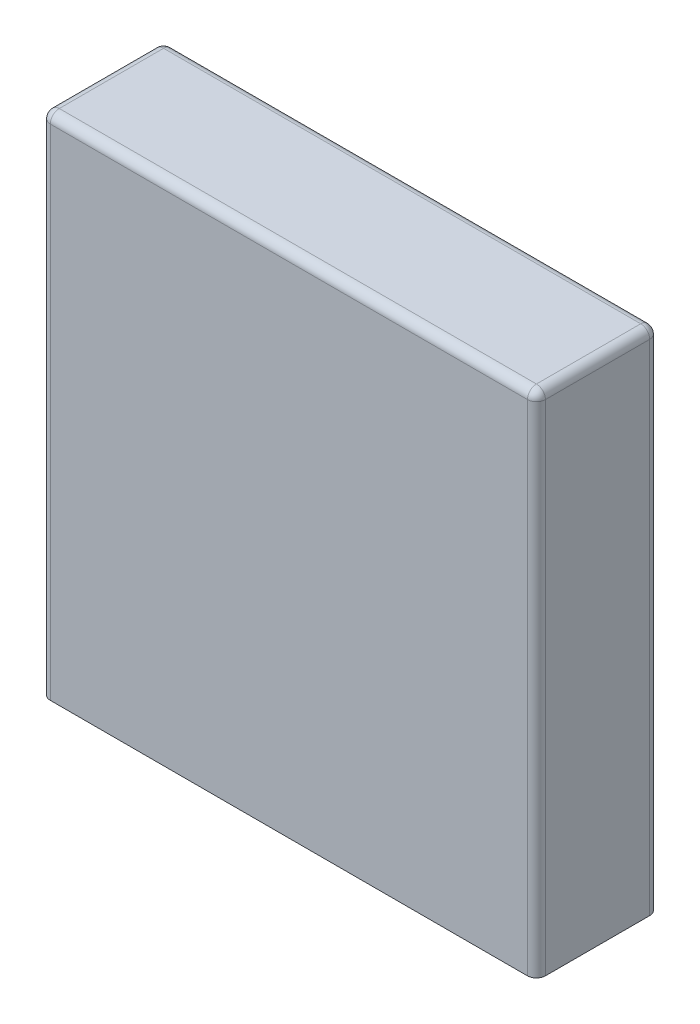
ISO-10303-21;
HEADER;
FILE_DESCRIPTION(('STEP AP214'),'2;1');
FILE_NAME('part.step','',(''),(''),'','','');
FILE_SCHEMA(('AUTOMOTIVE_DESIGN { 1 0 10303 214 1 1 1 1 }'));
ENDSEC;
DATA;
#1=APPLICATION_CONTEXT('core data for automotive mechanical design processes');
#2=APPLICATION_PROTOCOL_DEFINITION('international standard','automotive_design',2000,#1);
#3=PRODUCT_CONTEXT('',#1,'mechanical');
#4=PRODUCT('Part','Part','',(#3));
#5=PRODUCT_RELATED_PRODUCT_CATEGORY('part','',(#4));
#6=PRODUCT_DEFINITION_FORMATION('','',#4);
#7=PRODUCT_DEFINITION_CONTEXT('part definition',#1,'design');
#8=PRODUCT_DEFINITION('design','',#6,#7);
#9=PRODUCT_DEFINITION_SHAPE('','',#8);
#10=(LENGTH_UNIT() NAMED_UNIT(*) SI_UNIT(.MILLI.,.METRE.));
#11=(NAMED_UNIT(*) PLANE_ANGLE_UNIT() SI_UNIT($,.RADIAN.));
#12=(NAMED_UNIT(*) SI_UNIT($,.STERADIAN.) SOLID_ANGLE_UNIT());
#13=UNCERTAINTY_MEASURE_WITH_UNIT(LENGTH_MEASURE(1.E-05),#10,'distance_accuracy_value','');
#14=(GEOMETRIC_REPRESENTATION_CONTEXT(3) GLOBAL_UNCERTAINTY_ASSIGNED_CONTEXT((#13)) GLOBAL_UNIT_ASSIGNED_CONTEXT((#10,
#11,#12)) REPRESENTATION_CONTEXT('',''));
#15=CARTESIAN_POINT('',(0.,0.,0.));
#16=DIRECTION('',(0.,0.,1.));
#17=DIRECTION('',(1.,0.,0.));
#18=AXIS2_PLACEMENT_3D('',#15,#16,#17);
#19=CARTESIAN_POINT('',(-35.45,-84.45,17.));
#20=DIRECTION('',(0.,-1.,0.));
#21=DIRECTION('',(1.,0.,0.));
#22=AXIS2_PLACEMENT_3D('',#19,#20,#21);
#23=PLANE('',#22);
#24=CARTESIAN_POINT('',(35.45,-84.45,17.));
#25=DIRECTION('',(0.,1.,0.));
#26=DIRECTION('',(1.,0.,0.));
#27=AXIS2_PLACEMENT_3D('',#24,#25,#26);
#28=CIRCLE('',#27,2.5);
#29=CARTESIAN_POINT('',(37.95,-84.45,17.));
#30=VERTEX_POINT('',#29);
#31=CARTESIAN_POINT('',(32.95,-84.45,17.));
#32=VERTEX_POINT('',#31);
#33=EDGE_CURVE('E242',#30,#32,#28,.T.);
#34=ORIENTED_EDGE('',*,*,#33,.F.);
#35=CARTESIAN_POINT('',(35.45,-84.45,17.));
#36=DIRECTION('',(0.,1.,0.));
#37=DIRECTION('',(1.,0.,0.));
#38=AXIS2_PLACEMENT_3D('',#35,#36,#37);
#39=CIRCLE('',#38,2.5);
#40=EDGE_CURVE('E11',#32,#30,#39,.T.);
#41=ORIENTED_EDGE('',*,*,#40,.F.);
#42=EDGE_LOOP('',(#34,#41));
#43=FACE_BOUND('',#42,.T.);
#44=ADVANCED_FACE('F17',(#43),#23,.T.);
#45=CARTESIAN_POINT('',(35.45,-77.55,17.));
#46=DIRECTION('',(0.,-1.,0.));
#47=DIRECTION('',(1.,0.,0.));
#48=AXIS2_PLACEMENT_3D('',#45,#46,#47);
#49=CYLINDRICAL_SURFACE('',#48,2.5);
#50=DIRECTION('',(0.,1.,0.));
#51=VECTOR('',#50,1.);
#52=CARTESIAN_POINT('',(32.95,-77.55,17.));
#53=LINE('',#52,#51);
#54=CARTESIAN_POINT('',(32.95,-73.15,17.));
#55=VERTEX_POINT('',#54);
#56=EDGE_CURVE('E28',#32,#55,#53,.T.);
#57=ORIENTED_EDGE('',*,*,#56,.F.);
#58=ORIENTED_EDGE('',*,*,#40,.T.);
#59=DIRECTION('',(0.,1.,0.));
#60=VECTOR('',#59,1.);
#61=CARTESIAN_POINT('',(37.95,-77.55,17.));
#62=LINE('',#61,#60);
#63=CARTESIAN_POINT('',(37.95,-73.15,17.));
#64=VERTEX_POINT('',#63);
#65=EDGE_CURVE('E235',#30,#64,#62,.T.);
#66=ORIENTED_EDGE('',*,*,#65,.T.);
#67=CARTESIAN_POINT('',(35.45,-73.15,17.));
#68=DIRECTION('',(0.,1.,0.));
#69=DIRECTION('',(0.,0.,1.));
#70=AXIS2_PLACEMENT_3D('',#67,#68,#69);
#71=CIRCLE('',#70,2.5);
#72=EDGE_CURVE('E309',#55,#64,#71,.T.);
#73=ORIENTED_EDGE('',*,*,#72,.F.);
#74=EDGE_LOOP('',(#57,#58,#66,#73));
#75=FACE_BOUND('',#74,.T.);
#76=ADVANCED_FACE('F796',(#75),#49,.T.);
#77=CARTESIAN_POINT('',(35.45,-77.55,17.));
#78=DIRECTION('',(0.,-1.,0.));
#79=DIRECTION('',(1.,0.,0.));
#80=AXIS2_PLACEMENT_3D('',#77,#78,#79);
#81=CYLINDRICAL_SURFACE('',#80,2.5);
#82=ORIENTED_EDGE('',*,*,#65,.F.);
#83=ORIENTED_EDGE('',*,*,#33,.T.);
#84=ORIENTED_EDGE('',*,*,#56,.T.);
#85=CARTESIAN_POINT('',(35.45,-73.15,17.));
#86=DIRECTION('',(0.,1.,0.));
#87=DIRECTION('',(0.,0.,1.));
#88=AXIS2_PLACEMENT_3D('',#85,#86,#87);
#89=CIRCLE('',#88,2.5);
#90=EDGE_CURVE('E351',#64,#55,#89,.T.);
#91=ORIENTED_EDGE('',*,*,#90,.F.);
#92=EDGE_LOOP('',(#82,#83,#84,#91));
#93=FACE_BOUND('',#92,.T.);
#94=ADVANCED_FACE('F833',(#93),#81,.T.);
#95=CARTESIAN_POINT('',(35.45,-71.9,17.));
#96=DIRECTION('',(0.,-1.,0.));
#97=DIRECTION('',(1.,0.,0.));
#98=AXIS2_PLACEMENT_3D('',#95,#96,#97);
#99=CYLINDRICAL_SURFACE('',#98,5.);
#100=DIRECTION('',(0.,1.,0.));
#101=VECTOR('',#100,1.);
#102=CARTESIAN_POINT('',(40.45,-71.9,17.));
#103=LINE('',#102,#101);
#104=CARTESIAN_POINT('',(40.45,-73.15,17.));
#105=VERTEX_POINT('',#104);
#106=CARTESIAN_POINT('',(40.45,-70.65,17.));
#107=VERTEX_POINT('',#106);
#108=EDGE_CURVE('E263',#105,#107,#103,.T.);
#109=ORIENTED_EDGE('',*,*,#108,.F.);
#110=CARTESIAN_POINT('',(35.45,-73.15,17.));
#111=DIRECTION('',(0.,1.,0.));
#112=DIRECTION('',(0.,0.,1.));
#113=AXIS2_PLACEMENT_3D('',#110,#111,#112);
#114=CIRCLE('',#113,5.);
#115=CARTESIAN_POINT('',(30.45,-73.15,17.));
#116=VERTEX_POINT('',#115);
#117=EDGE_CURVE('E258',#105,#116,#114,.T.);
#118=ORIENTED_EDGE('',*,*,#117,.T.);
#119=DIRECTION('',(0.,1.,0.));
#120=VECTOR('',#119,1.);
#121=CARTESIAN_POINT('',(30.45,-71.9,17.));
#122=LINE('',#121,#120);
#123=CARTESIAN_POINT('',(30.45,-70.65,17.));
#124=VERTEX_POINT('',#123);
#125=EDGE_CURVE('E266',#116,#124,#122,.T.);
#126=ORIENTED_EDGE('',*,*,#125,.T.);
#127=CARTESIAN_POINT('',(35.45,-70.65,17.));
#128=DIRECTION('',(0.,1.,0.));
#129=DIRECTION('',(-1.,0.,0.));
#130=AXIS2_PLACEMENT_3D('',#127,#128,#129);
#131=CIRCLE('',#130,5.);
#132=EDGE_CURVE('E231',#107,#124,#131,.T.);
#133=ORIENTED_EDGE('',*,*,#132,.F.);
#134=EDGE_LOOP('',(#109,#118,#126,#133));
#135=FACE_BOUND('',#134,.T.);
#136=ADVANCED_FACE('F776',(#135),#99,.T.);
#137=CARTESIAN_POINT('',(35.45,-71.9,17.));
#138=DIRECTION('',(0.,-1.,0.));
#139=DIRECTION('',(1.,0.,0.));
#140=AXIS2_PLACEMENT_3D('',#137,#138,#139);
#141=CYLINDRICAL_SURFACE('',#140,5.);
#142=ORIENTED_EDGE('',*,*,#125,.F.);
#143=CARTESIAN_POINT('',(35.45,-73.15,17.));
#144=DIRECTION('',(0.,1.,0.));
#145=DIRECTION('',(0.,0.,1.));
#146=AXIS2_PLACEMENT_3D('',#143,#144,#145);
#147=CIRCLE('',#146,5.);
#148=EDGE_CURVE('E262',#116,#105,#147,.T.);
#149=ORIENTED_EDGE('',*,*,#148,.T.);
#150=ORIENTED_EDGE('',*,*,#108,.T.);
#151=CARTESIAN_POINT('',(35.45,-70.65,17.));
#152=DIRECTION('',(0.,1.,0.));
#153=DIRECTION('',(-1.,0.,0.));
#154=AXIS2_PLACEMENT_3D('',#151,#152,#153);
#155=CIRCLE('',#154,5.);
#156=EDGE_CURVE('E220',#124,#107,#155,.T.);
#157=ORIENTED_EDGE('',*,*,#156,.F.);
#158=EDGE_LOOP('',(#142,#149,#150,#157));
#159=FACE_BOUND('',#158,.T.);
#160=ADVANCED_FACE('F855',(#159),#141,.T.);
#161=CARTESIAN_POINT('',(-35.45,-73.15,17.));
#162=DIRECTION('',(0.,1.,0.));
#163=DIRECTION('',(0.,0.,1.));
#164=AXIS2_PLACEMENT_3D('',#161,#162,#163);
#165=PLANE('',#164);
#166=ORIENTED_EDGE('',*,*,#72,.T.);
#167=ORIENTED_EDGE('',*,*,#90,.T.);
#168=EDGE_LOOP('',(#166,#167));
#169=FACE_BOUND('',#168,.T.);
#170=ORIENTED_EDGE('',*,*,#117,.F.);
#171=ORIENTED_EDGE('',*,*,#148,.F.);
#172=EDGE_LOOP('',(#170,#171));
#173=FACE_BOUND('',#172,.T.);
#174=ADVANCED_FACE('F817',(#169,#173),#165,.F.);
#175=CARTESIAN_POINT('',(-35.45,-84.45,17.));
#176=DIRECTION('',(0.,-1.,0.));
#177=DIRECTION('',(1.,0.,0.));
#178=AXIS2_PLACEMENT_3D('',#175,#176,#177);
#179=PLANE('',#178);
#180=CARTESIAN_POINT('',(-35.45,-84.45,17.));
#181=DIRECTION('',(0.,1.,0.));
#182=DIRECTION('',(1.,0.,0.));
#183=AXIS2_PLACEMENT_3D('',#180,#181,#182);
#184=CIRCLE('',#183,2.5);
#185=CARTESIAN_POINT('',(-32.95,-84.45,17.));
#186=VERTEX_POINT('',#185);
#187=CARTESIAN_POINT('',(-37.95,-84.45,17.));
#188=VERTEX_POINT('',#187);
#189=EDGE_CURVE('E257',#186,#188,#184,.T.);
#190=ORIENTED_EDGE('',*,*,#189,.F.);
#191=CARTESIAN_POINT('',(-35.45,-84.45,17.));
#192=DIRECTION('',(0.,1.,0.));
#193=DIRECTION('',(1.,0.,0.));
#194=AXIS2_PLACEMENT_3D('',#191,#192,#193);
#195=CIRCLE('',#194,2.5);
#196=EDGE_CURVE('E256',#188,#186,#195,.T.);
#197=ORIENTED_EDGE('',*,*,#196,.F.);
#198=EDGE_LOOP('',(#190,#197));
#199=FACE_BOUND('',#198,.T.);
#200=ADVANCED_FACE('F920',(#199),#179,.T.);
#201=CARTESIAN_POINT('',(-35.45,-77.55,17.));
#202=DIRECTION('',(0.,-1.,0.));
#203=DIRECTION('',(1.,0.,0.));
#204=AXIS2_PLACEMENT_3D('',#201,#202,#203);
#205=CYLINDRICAL_SURFACE('',#204,2.5);
#206=DIRECTION('',(0.,1.,0.));
#207=VECTOR('',#206,1.);
#208=CARTESIAN_POINT('',(-37.95,-77.55,17.));
#209=LINE('',#208,#207);
#210=CARTESIAN_POINT('',(-37.95,-73.15,17.));
#211=VERTEX_POINT('',#210);
#212=EDGE_CURVE('E253',#188,#211,#209,.T.);
#213=ORIENTED_EDGE('',*,*,#212,.F.);
#214=ORIENTED_EDGE('',*,*,#196,.T.);
#215=DIRECTION('',(0.,1.,0.));
#216=VECTOR('',#215,1.);
#217=CARTESIAN_POINT('',(-32.95,-77.55,17.));
#218=LINE('',#217,#216);
#219=CARTESIAN_POINT('',(-32.95,-73.15,17.));
#220=VERTEX_POINT('',#219);
#221=EDGE_CURVE('E288',#186,#220,#218,.T.);
#222=ORIENTED_EDGE('',*,*,#221,.T.);
#223=CARTESIAN_POINT('',(-35.45,-73.15,17.));
#224=DIRECTION('',(0.,1.,0.));
#225=DIRECTION('',(0.,0.,1.));
#226=AXIS2_PLACEMENT_3D('',#223,#224,#225);
#227=CIRCLE('',#226,2.5);
#228=EDGE_CURVE('E344',#211,#220,#227,.T.);
#229=ORIENTED_EDGE('',*,*,#228,.F.);
#230=EDGE_LOOP('',(#213,#214,#222,#229));
#231=FACE_BOUND('',#230,.T.);
#232=ADVANCED_FACE('F770',(#231),#205,.T.);
#233=CARTESIAN_POINT('',(-35.45,-77.55,17.));
#234=DIRECTION('',(0.,-1.,0.));
#235=DIRECTION('',(1.,0.,0.));
#236=AXIS2_PLACEMENT_3D('',#233,#234,#235);
#237=CYLINDRICAL_SURFACE('',#236,2.5);
#238=ORIENTED_EDGE('',*,*,#221,.F.);
#239=ORIENTED_EDGE('',*,*,#189,.T.);
#240=ORIENTED_EDGE('',*,*,#212,.T.);
#241=CARTESIAN_POINT('',(-35.45,-73.15,17.));
#242=DIRECTION('',(0.,1.,0.));
#243=DIRECTION('',(0.,0.,1.));
#244=AXIS2_PLACEMENT_3D('',#241,#242,#243);
#245=CIRCLE('',#244,2.5);
#246=EDGE_CURVE('E284',#220,#211,#245,.T.);
#247=ORIENTED_EDGE('',*,*,#246,.F.);
#248=EDGE_LOOP('',(#238,#239,#240,#247));
#249=FACE_BOUND('',#248,.T.);
#250=ADVANCED_FACE('F890',(#249),#237,.T.);
#251=CARTESIAN_POINT('',(-35.45,-71.9,17.));
#252=DIRECTION('',(0.,-1.,0.));
#253=DIRECTION('',(1.,0.,0.));
#254=AXIS2_PLACEMENT_3D('',#251,#252,#253);
#255=CYLINDRICAL_SURFACE('',#254,5.);
#256=DIRECTION('',(0.,1.,0.));
#257=VECTOR('',#256,1.);
#258=CARTESIAN_POINT('',(-30.45,-71.9,17.));
#259=LINE('',#258,#257);
#260=CARTESIAN_POINT('',(-30.45,-73.15,17.));
#261=VERTEX_POINT('',#260);
#262=CARTESIAN_POINT('',(-30.45,-70.65,17.));
#263=VERTEX_POINT('',#262);
#264=EDGE_CURVE('E283',#261,#263,#259,.T.);
#265=ORIENTED_EDGE('',*,*,#264,.F.);
#266=CARTESIAN_POINT('',(-35.45,-73.15,17.));
#267=DIRECTION('',(0.,1.,0.));
#268=DIRECTION('',(0.,0.,1.));
#269=AXIS2_PLACEMENT_3D('',#266,#267,#268);
#270=CIRCLE('',#269,5.);
#271=CARTESIAN_POINT('',(-40.45,-73.15,17.));
#272=VERTEX_POINT('',#271);
#273=EDGE_CURVE('E279',#261,#272,#270,.T.);
#274=ORIENTED_EDGE('',*,*,#273,.T.);
#275=DIRECTION('',(0.,1.,0.));
#276=VECTOR('',#275,1.);
#277=CARTESIAN_POINT('',(-40.45,-71.9,17.));
#278=LINE('',#277,#276);
#279=CARTESIAN_POINT('',(-40.45,-70.65,17.));
#280=VERTEX_POINT('',#279);
#281=EDGE_CURVE('E281',#272,#280,#278,.T.);
#282=ORIENTED_EDGE('',*,*,#281,.T.);
#283=CARTESIAN_POINT('',(-35.45,-70.65,17.));
#284=DIRECTION('',(0.,1.,0.));
#285=DIRECTION('',(-1.,0.,0.));
#286=AXIS2_PLACEMENT_3D('',#283,#284,#285);
#287=CIRCLE('',#286,5.);
#288=EDGE_CURVE('E368',#263,#280,#287,.T.);
#289=ORIENTED_EDGE('',*,*,#288,.F.);
#290=EDGE_LOOP('',(#265,#274,#282,#289));
#291=FACE_BOUND('',#290,.T.);
#292=ADVANCED_FACE('F869',(#291),#255,.T.);
#293=CARTESIAN_POINT('',(-35.45,-71.9,17.));
#294=DIRECTION('',(0.,-1.,0.));
#295=DIRECTION('',(1.,0.,0.));
#296=AXIS2_PLACEMENT_3D('',#293,#294,#295);
#297=CYLINDRICAL_SURFACE('',#296,5.);
#298=ORIENTED_EDGE('',*,*,#281,.F.);
#299=CARTESIAN_POINT('',(-35.45,-73.15,17.));
#300=DIRECTION('',(0.,1.,0.));
#301=DIRECTION('',(0.,0.,1.));
#302=AXIS2_PLACEMENT_3D('',#299,#300,#301);
#303=CIRCLE('',#302,5.);
#304=EDGE_CURVE('E347',#272,#261,#303,.T.);
#305=ORIENTED_EDGE('',*,*,#304,.T.);
#306=ORIENTED_EDGE('',*,*,#264,.T.);
#307=CARTESIAN_POINT('',(-35.45,-70.65,17.));
#308=DIRECTION('',(0.,1.,0.));
#309=DIRECTION('',(-1.,0.,0.));
#310=AXIS2_PLACEMENT_3D('',#307,#308,#309);
#311=CIRCLE('',#310,5.);
#312=EDGE_CURVE('E361',#280,#263,#311,.T.);
#313=ORIENTED_EDGE('',*,*,#312,.F.);
#314=EDGE_LOOP('',(#298,#305,#306,#313));
#315=FACE_BOUND('',#314,.T.);
#316=ADVANCED_FACE('F913',(#315),#297,.T.);
#317=CARTESIAN_POINT('',(-35.45,-73.15,17.));
#318=DIRECTION('',(0.,1.,0.));
#319=DIRECTION('',(0.,0.,1.));
#320=AXIS2_PLACEMENT_3D('',#317,#318,#319);
#321=PLANE('',#320);
#322=ORIENTED_EDGE('',*,*,#228,.T.);
#323=ORIENTED_EDGE('',*,*,#246,.T.);
#324=EDGE_LOOP('',(#322,#323));
#325=FACE_BOUND('',#324,.T.);
#326=ORIENTED_EDGE('',*,*,#273,.F.);
#327=ORIENTED_EDGE('',*,*,#304,.F.);
#328=EDGE_LOOP('',(#326,#327));
#329=FACE_BOUND('',#328,.T.);
#330=ADVANCED_FACE('F802',(#325,#329),#321,.F.);
#331=CARTESIAN_POINT('',(0.,0.,34.));
#332=DIRECTION('',(0.,0.,1.));
#333=DIRECTION('',(1.,0.,0.));
#334=AXIS2_PLACEMENT_3D('',#331,#332,#333);
#335=PLANE('',#334);
#336=DIRECTION('',(0.,-1.,0.));
#337=VECTOR('',#336,1.);
#338=CARTESIAN_POINT('',(-66.35,-1.25,34.));
#339=LINE('',#338,#337);
#340=CARTESIAN_POINT('',(-66.35,68.15,34.));
#341=VERTEX_POINT('',#340);
#342=CARTESIAN_POINT('',(-66.35,-70.65,34.));
#343=VERTEX_POINT('',#342);
#344=EDGE_CURVE('E314',#341,#343,#339,.T.);
#345=ORIENTED_EDGE('',*,*,#344,.T.);
#346=DIRECTION('',(1.,0.,0.));
#347=VECTOR('',#346,1.);
#348=CARTESIAN_POINT('',(0.,-70.65,34.));
#349=LINE('',#348,#347);
#350=CARTESIAN_POINT('',(66.35,-70.65,34.));
#351=VERTEX_POINT('',#350);
#352=EDGE_CURVE('E274',#343,#351,#349,.T.);
#353=ORIENTED_EDGE('',*,*,#352,.T.);
#354=DIRECTION('',(0.,1.,0.));
#355=VECTOR('',#354,1.);
#356=CARTESIAN_POINT('',(66.35,-1.25,34.));
#357=LINE('',#356,#355);
#358=CARTESIAN_POINT('',(66.35,68.15,34.));
#359=VERTEX_POINT('',#358);
#360=EDGE_CURVE('E289',#351,#359,#357,.T.);
#361=ORIENTED_EDGE('',*,*,#360,.T.);
#362=DIRECTION('',(1.,0.,0.));
#363=VECTOR('',#362,1.);
#364=CARTESIAN_POINT('',(0.,68.15,34.));
#365=LINE('',#364,#363);
#366=EDGE_CURVE('E276',#341,#359,#365,.T.);
#367=ORIENTED_EDGE('',*,*,#366,.F.);
#368=EDGE_LOOP('',(#345,#353,#361,#367));
#369=FACE_BOUND('',#368,.T.);
#370=ADVANCED_FACE('F409',(#369),#335,.T.);
#371=CARTESIAN_POINT('',(0.,0.,0.));
#372=DIRECTION('',(0.,0.,1.));
#373=DIRECTION('',(1.,0.,0.));
#374=AXIS2_PLACEMENT_3D('',#371,#372,#373);
#375=PLANE('',#374);
#376=DIRECTION('',(-1.,0.,0.));
#377=VECTOR('',#376,1.);
#378=CARTESIAN_POINT('',(0.,68.15,0.));
#379=LINE('',#378,#377);
#380=CARTESIAN_POINT('',(66.35,68.15,0.));
#381=VERTEX_POINT('',#380);
#382=CARTESIAN_POINT('',(-66.35,68.15,0.));
#383=VERTEX_POINT('',#382);
#384=EDGE_CURVE('E280',#381,#383,#379,.T.);
#385=ORIENTED_EDGE('',*,*,#384,.F.);
#386=DIRECTION('',(0.,1.,0.));
#387=VECTOR('',#386,1.);
#388=CARTESIAN_POINT('',(66.35,-1.25,0.));
#389=LINE('',#388,#387);
#390=CARTESIAN_POINT('',(66.35,-70.65,0.));
#391=VERTEX_POINT('',#390);
#392=EDGE_CURVE('E189',#391,#381,#389,.T.);
#393=ORIENTED_EDGE('',*,*,#392,.F.);
#394=DIRECTION('',(1.,0.,0.));
#395=VECTOR('',#394,1.);
#396=CARTESIAN_POINT('',(0.,-70.65,0.));
#397=LINE('',#396,#395);
#398=CARTESIAN_POINT('',(-66.35,-70.65,0.));
#399=VERTEX_POINT('',#398);
#400=EDGE_CURVE('E21',#399,#391,#397,.T.);
#401=ORIENTED_EDGE('',*,*,#400,.F.);
#402=DIRECTION('',(0.,-1.,0.));
#403=VECTOR('',#402,1.);
#404=CARTESIAN_POINT('',(-66.35,-1.25,0.));
#405=LINE('',#404,#403);
#406=EDGE_CURVE('E271',#383,#399,#405,.T.);
#407=ORIENTED_EDGE('',*,*,#406,.F.);
#408=EDGE_LOOP('',(#385,#393,#401,#407));
#409=FACE_BOUND('',#408,.T.);
#410=ADVANCED_FACE('F19',(#409),#375,.F.);
#411=CARTESIAN_POINT('',(0.,68.15,31.5));
#412=DIRECTION('',(-1.,0.,0.));
#413=DIRECTION('',(0.,0.,1.));
#414=AXIS2_PLACEMENT_3D('',#411,#412,#413);
#415=CYLINDRICAL_SURFACE('',#414,2.5);
#416=CARTESIAN_POINT('',(-66.35,68.15,31.5));
#417=DIRECTION('',(1.,0.,0.));
#418=DIRECTION('',(0.,0.,1.));
#419=AXIS2_PLACEMENT_3D('',#416,#417,#418);
#420=CIRCLE('',#419,2.5);
#421=CARTESIAN_POINT('',(-66.35,70.65,31.5));
#422=VERTEX_POINT('',#421);
#423=EDGE_CURVE('E267',#422,#341,#420,.T.);
#424=ORIENTED_EDGE('',*,*,#423,.T.);
#425=ORIENTED_EDGE('',*,*,#366,.T.);
#426=CARTESIAN_POINT('',(66.35,68.15,31.5));
#427=DIRECTION('',(1.,0.,0.));
#428=DIRECTION('',(0.,0.,1.));
#429=AXIS2_PLACEMENT_3D('',#426,#427,#428);
#430=CIRCLE('',#429,2.5);
#431=CARTESIAN_POINT('',(66.35,70.65,31.5));
#432=VERTEX_POINT('',#431);
#433=EDGE_CURVE('E185',#432,#359,#430,.T.);
#434=ORIENTED_EDGE('',*,*,#433,.F.);
#435=DIRECTION('',(1.,0.,0.));
#436=VECTOR('',#435,1.);
#437=CARTESIAN_POINT('',(0.,70.65,31.5));
#438=LINE('',#437,#436);
#439=EDGE_CURVE('E379',#422,#432,#438,.T.);
#440=ORIENTED_EDGE('',*,*,#439,.F.);
#441=EDGE_LOOP('',(#424,#425,#434,#440));
#442=FACE_BOUND('',#441,.T.);
#443=ADVANCED_FACE('F823',(#442),#415,.T.);
#444=CARTESIAN_POINT('',(0.,68.15,2.5));
#445=DIRECTION('',(-1.,0.,0.));
#446=DIRECTION('',(0.,0.,-1.));
#447=AXIS2_PLACEMENT_3D('',#444,#445,#446);
#448=CYLINDRICAL_SURFACE('',#447,2.5);
#449=CARTESIAN_POINT('',(66.35,68.15,2.5));
#450=DIRECTION('',(-1.,0.,0.));
#451=DIRECTION('',(0.,0.,-1.));
#452=AXIS2_PLACEMENT_3D('',#449,#450,#451);
#453=CIRCLE('',#452,2.5);
#454=CARTESIAN_POINT('',(66.35,70.65,2.5));
#455=VERTEX_POINT('',#454);
#456=EDGE_CURVE('E248',#455,#381,#453,.T.);
#457=ORIENTED_EDGE('',*,*,#456,.T.);
#458=ORIENTED_EDGE('',*,*,#384,.T.);
#459=CARTESIAN_POINT('',(-66.35,68.15,2.5));
#460=DIRECTION('',(-1.,0.,0.));
#461=DIRECTION('',(0.,0.,-1.));
#462=AXIS2_PLACEMENT_3D('',#459,#460,#461);
#463=CIRCLE('',#462,2.5);
#464=CARTESIAN_POINT('',(-66.35,70.65,2.5));
#465=VERTEX_POINT('',#464);
#466=EDGE_CURVE('E319',#465,#383,#463,.T.);
#467=ORIENTED_EDGE('',*,*,#466,.F.);
#468=DIRECTION('',(-1.,0.,0.));
#469=VECTOR('',#468,1.);
#470=CARTESIAN_POINT('',(0.,70.65,2.5));
#471=LINE('',#470,#469);
#472=EDGE_CURVE('E293',#455,#465,#471,.T.);
#473=ORIENTED_EDGE('',*,*,#472,.F.);
#474=EDGE_LOOP('',(#457,#458,#467,#473));
#475=FACE_BOUND('',#474,.T.);
#476=ADVANCED_FACE('F845',(#475),#448,.T.);
#477=CARTESIAN_POINT('',(-68.85,70.65,0.));
#478=DIRECTION('',(0.,-1.,0.));
#479=DIRECTION('',(1.,0.,0.));
#480=AXIS2_PLACEMENT_3D('',#477,#478,#479);
#481=PLANE('',#480);
#482=ORIENTED_EDGE('',*,*,#472,.T.);
#483=DIRECTION('',(0.,0.,1.));
#484=VECTOR('',#483,1.);
#485=CARTESIAN_POINT('',(-66.35,70.65,17.));
#486=LINE('',#485,#484);
#487=EDGE_CURVE('E240',#465,#422,#486,.T.);
#488=ORIENTED_EDGE('',*,*,#487,.T.);
#489=ORIENTED_EDGE('',*,*,#439,.T.);
#490=DIRECTION('',(0.,0.,-1.));
#491=VECTOR('',#490,1.);
#492=CARTESIAN_POINT('',(66.35,70.65,17.));
#493=LINE('',#492,#491);
#494=EDGE_CURVE('E201',#432,#455,#493,.T.);
#495=ORIENTED_EDGE('',*,*,#494,.T.);
#496=EDGE_LOOP('',(#482,#488,#489,#495));
#497=FACE_BOUND('',#496,.T.);
#498=ADVANCED_FACE('F873',(#497),#481,.F.);
#499=CARTESIAN_POINT('',(66.35,0.,31.5));
#500=DIRECTION('',(0.,-1.,0.));
#501=DIRECTION('',(1.,0.,0.));
#502=AXIS2_PLACEMENT_3D('',#499,#500,#501);
#503=CYLINDRICAL_SURFACE('',#502,2.5);
#504=ORIENTED_EDGE('',*,*,#360,.F.);
#505=CARTESIAN_POINT('',(66.35,-70.65,31.5));
#506=DIRECTION('',(0.,1.,0.));
#507=DIRECTION('',(-1.,0.,0.));
#508=AXIS2_PLACEMENT_3D('',#505,#506,#507);
#509=CIRCLE('',#508,2.5);
#510=CARTESIAN_POINT('',(68.85,-70.65,31.5));
#511=VERTEX_POINT('',#510);
#512=EDGE_CURVE('E217',#351,#511,#509,.T.);
#513=ORIENTED_EDGE('',*,*,#512,.T.);
#514=DIRECTION('',(0.,1.,0.));
#515=VECTOR('',#514,1.);
#516=CARTESIAN_POINT('',(68.85,-1.25,31.5));
#517=LINE('',#516,#515);
#518=CARTESIAN_POINT('',(68.85,68.15,31.5));
#519=VERTEX_POINT('',#518);
#520=EDGE_CURVE('E209',#511,#519,#517,.T.);
#521=ORIENTED_EDGE('',*,*,#520,.T.);
#522=CARTESIAN_POINT('',(66.35,68.15,31.5));
#523=DIRECTION('',(0.,1.,0.));
#524=DIRECTION('',(1.,0.,0.));
#525=AXIS2_PLACEMENT_3D('',#522,#523,#524);
#526=CIRCLE('',#525,2.5);
#527=EDGE_CURVE('E179',#359,#519,#526,.T.);
#528=ORIENTED_EDGE('',*,*,#527,.F.);
#529=EDGE_LOOP('',(#504,#513,#521,#528));
#530=FACE_BOUND('',#529,.T.);
#531=ADVANCED_FACE('F215',(#530),#503,.T.);
#532=CARTESIAN_POINT('',(66.35,0.,2.5));
#533=DIRECTION('',(0.,-1.,0.));
#534=DIRECTION('',(0.,0.,-1.));
#535=AXIS2_PLACEMENT_3D('',#532,#533,#534);
#536=CYLINDRICAL_SURFACE('',#535,2.5);
#537=DIRECTION('',(0.,1.,0.));
#538=VECTOR('',#537,1.);
#539=CARTESIAN_POINT('',(68.85,-1.25,2.5));
#540=LINE('',#539,#538);
#541=CARTESIAN_POINT('',(68.85,-70.65,2.5));
#542=VERTEX_POINT('',#541);
#543=CARTESIAN_POINT('',(68.85,68.15,2.5));
#544=VERTEX_POINT('',#543);
#545=EDGE_CURVE('E211',#542,#544,#540,.T.);
#546=ORIENTED_EDGE('',*,*,#545,.F.);
#547=CARTESIAN_POINT('',(66.35,-70.65,2.5));
#548=DIRECTION('',(0.,1.,0.));
#549=DIRECTION('',(-1.,0.,0.));
#550=AXIS2_PLACEMENT_3D('',#547,#548,#549);
#551=CIRCLE('',#550,2.5);
#552=EDGE_CURVE('E252',#542,#391,#551,.T.);
#553=ORIENTED_EDGE('',*,*,#552,.T.);
#554=ORIENTED_EDGE('',*,*,#392,.T.);
#555=CARTESIAN_POINT('',(66.35,68.15,2.5));
#556=DIRECTION('',(0.,1.,0.));
#557=DIRECTION('',(0.,0.,-1.));
#558=AXIS2_PLACEMENT_3D('',#555,#556,#557);
#559=CIRCLE('',#558,2.5);
#560=EDGE_CURVE('E356',#544,#381,#559,.T.);
#561=ORIENTED_EDGE('',*,*,#560,.F.);
#562=EDGE_LOOP('',(#546,#553,#554,#561));
#563=FACE_BOUND('',#562,.T.);
#564=ADVANCED_FACE('F420',(#563),#536,.T.);
#565=CARTESIAN_POINT('',(66.35,68.15,31.5));
#566=DIRECTION('',(0.,1.,0.));
#567=DIRECTION('',(0.965925826289068,0.,-0.258819045102521));
#568=AXIS2_PLACEMENT_3D('',#565,#566,#567);
#569=SPHERICAL_SURFACE('',#568,2.5);
#570=ORIENTED_EDGE('',*,*,#433,.T.);
#571=ORIENTED_EDGE('',*,*,#527,.T.);
#572=CARTESIAN_POINT('',(66.35,68.15,31.5));
#573=DIRECTION('',(0.,0.,-1.));
#574=DIRECTION('',(1.,0.,0.));
#575=AXIS2_PLACEMENT_3D('',#572,#573,#574);
#576=CIRCLE('',#575,2.5);
#577=EDGE_CURVE('E183',#432,#519,#576,.T.);
#578=ORIENTED_EDGE('',*,*,#577,.F.);
#579=EDGE_LOOP('',(#570,#571,#578));
#580=FACE_BOUND('',#579,.T.);
#581=ADVANCED_FACE('F182',(#580),#569,.T.);
#582=CARTESIAN_POINT('',(66.35,68.15,2.5));
#583=DIRECTION('',(0.,1.,0.));
#584=DIRECTION('',(-0.258819045102519,0.,-0.965925826289069));
#585=AXIS2_PLACEMENT_3D('',#582,#583,#584);
#586=SPHERICAL_SURFACE('',#585,2.5);
#587=CARTESIAN_POINT('',(66.35,68.15,2.5));
#588=DIRECTION('',(0.,0.,-1.));
#589=DIRECTION('',(1.,0.,0.));
#590=AXIS2_PLACEMENT_3D('',#587,#588,#589);
#591=CIRCLE('',#590,2.5);
#592=EDGE_CURVE('E203',#455,#544,#591,.T.);
#593=ORIENTED_EDGE('',*,*,#592,.T.);
#594=ORIENTED_EDGE('',*,*,#560,.T.);
#595=ORIENTED_EDGE('',*,*,#456,.F.);
#596=EDGE_LOOP('',(#593,#594,#595));
#597=FACE_BOUND('',#596,.T.);
#598=ADVANCED_FACE('F426',(#597),#586,.T.);
#599=CARTESIAN_POINT('',(66.35,68.15,17.));
#600=DIRECTION('',(0.,0.,-1.));
#601=DIRECTION('',(1.,0.,0.));
#602=AXIS2_PLACEMENT_3D('',#599,#600,#601);
#603=CYLINDRICAL_SURFACE('',#602,2.5);
#604=ORIENTED_EDGE('',*,*,#577,.T.);
#605=DIRECTION('',(0.,0.,-1.));
#606=VECTOR('',#605,1.);
#607=CARTESIAN_POINT('',(68.85,68.15,17.));
#608=LINE('',#607,#606);
#609=EDGE_CURVE('E198',#519,#544,#608,.T.);
#610=ORIENTED_EDGE('',*,*,#609,.T.);
#611=ORIENTED_EDGE('',*,*,#592,.F.);
#612=ORIENTED_EDGE('',*,*,#494,.F.);
#613=EDGE_LOOP('',(#604,#610,#611,#612));
#614=FACE_BOUND('',#613,.T.);
#615=ADVANCED_FACE('F196',(#614),#603,.T.);
#616=CARTESIAN_POINT('',(68.85,-70.65,0.));
#617=DIRECTION('',(1.,0.,0.));
#618=DIRECTION('',(0.,1.,0.));
#619=AXIS2_PLACEMENT_3D('',#616,#617,#618);
#620=PLANE('',#619);
#621=ORIENTED_EDGE('',*,*,#520,.F.);
#622=DIRECTION('',(0.,0.,1.));
#623=VECTOR('',#622,1.);
#624=CARTESIAN_POINT('',(68.85,-70.65,17.));
#625=LINE('',#624,#623);
#626=EDGE_CURVE('E249',#542,#511,#625,.T.);
#627=ORIENTED_EDGE('',*,*,#626,.F.);
#628=ORIENTED_EDGE('',*,*,#545,.T.);
#629=ORIENTED_EDGE('',*,*,#609,.F.);
#630=EDGE_LOOP('',(#621,#627,#628,#629));
#631=FACE_BOUND('',#630,.T.);
#632=ADVANCED_FACE('F207',(#631),#620,.T.);
#633=CARTESIAN_POINT('',(68.85,-70.65,0.));
#634=DIRECTION('',(0.,1.,0.));
#635=DIRECTION('',(-1.,0.,0.));
#636=AXIS2_PLACEMENT_3D('',#633,#634,#635);
#637=PLANE('',#636);
#638=ORIENTED_EDGE('',*,*,#132,.T.);
#639=ORIENTED_EDGE('',*,*,#156,.T.);
#640=EDGE_LOOP('',(#638,#639));
#641=FACE_BOUND('',#640,.T.);
#642=ORIENTED_EDGE('',*,*,#288,.T.);
#643=ORIENTED_EDGE('',*,*,#312,.T.);
#644=EDGE_LOOP('',(#642,#643));
#645=FACE_BOUND('',#644,.T.);
#646=CARTESIAN_POINT('',(-66.35,-70.65,31.5));
#647=DIRECTION('',(0.,1.,0.));
#648=DIRECTION('',(-1.,0.,0.));
#649=AXIS2_PLACEMENT_3D('',#646,#647,#648);
#650=CIRCLE('',#649,2.5);
#651=CARTESIAN_POINT('',(-68.85,-70.65,31.5));
#652=VERTEX_POINT('',#651);
#653=EDGE_CURVE('E310',#652,#343,#650,.T.);
#654=ORIENTED_EDGE('',*,*,#653,.F.);
#655=DIRECTION('',(0.,0.,1.));
#656=VECTOR('',#655,1.);
#657=CARTESIAN_POINT('',(-68.85,-70.65,17.));
#658=LINE('',#657,#656);
#659=CARTESIAN_POINT('',(-68.85,-70.65,2.5));
#660=VERTEX_POINT('',#659);
#661=EDGE_CURVE('E305',#660,#652,#658,.T.);
#662=ORIENTED_EDGE('',*,*,#661,.F.);
#663=CARTESIAN_POINT('',(-66.35,-70.65,2.5));
#664=DIRECTION('',(0.,1.,0.));
#665=DIRECTION('',(-1.,0.,0.));
#666=AXIS2_PLACEMENT_3D('',#663,#664,#665);
#667=CIRCLE('',#666,2.5);
#668=EDGE_CURVE('E315',#399,#660,#667,.T.);
#669=ORIENTED_EDGE('',*,*,#668,.F.);
#670=ORIENTED_EDGE('',*,*,#400,.T.);
#671=ORIENTED_EDGE('',*,*,#552,.F.);
#672=ORIENTED_EDGE('',*,*,#626,.T.);
#673=ORIENTED_EDGE('',*,*,#512,.F.);
#674=ORIENTED_EDGE('',*,*,#352,.F.);
#675=EDGE_LOOP('',(#654,#662,#669,#670,#671,#672,#673,#674));
#676=FACE_BOUND('',#675,.T.);
#677=ADVANCED_FACE('F413',(#641,#645,#676),#637,.F.);
#678=CARTESIAN_POINT('',(-66.35,0.,31.5));
#679=DIRECTION('',(0.,1.,0.));
#680=DIRECTION('',(-1.,0.,0.));
#681=AXIS2_PLACEMENT_3D('',#678,#679,#680);
#682=CYLINDRICAL_SURFACE('',#681,2.5);
#683=DIRECTION('',(0.,-1.,0.));
#684=VECTOR('',#683,1.);
#685=CARTESIAN_POINT('',(-68.85,-1.25,31.5));
#686=LINE('',#685,#684);
#687=CARTESIAN_POINT('',(-68.85,68.15,31.5));
#688=VERTEX_POINT('',#687);
#689=EDGE_CURVE('E301',#688,#652,#686,.T.);
#690=ORIENTED_EDGE('',*,*,#689,.T.);
#691=ORIENTED_EDGE('',*,*,#653,.T.);
#692=ORIENTED_EDGE('',*,*,#344,.F.);
#693=CARTESIAN_POINT('',(-66.35,68.15,31.5));
#694=DIRECTION('',(0.,1.,0.));
#695=DIRECTION('',(-1.,0.,0.));
#696=AXIS2_PLACEMENT_3D('',#693,#694,#695);
#697=CIRCLE('',#696,2.5);
#698=EDGE_CURVE('E272',#688,#341,#697,.T.);
#699=ORIENTED_EDGE('',*,*,#698,.F.);
#700=EDGE_LOOP('',(#690,#691,#692,#699));
#701=FACE_BOUND('',#700,.T.);
#702=ADVANCED_FACE('F462',(#701),#682,.T.);
#703=CARTESIAN_POINT('',(-66.35,0.,2.5));
#704=DIRECTION('',(0.,1.,0.));
#705=DIRECTION('',(0.,0.,-1.));
#706=AXIS2_PLACEMENT_3D('',#703,#704,#705);
#707=CYLINDRICAL_SURFACE('',#706,2.5);
#708=ORIENTED_EDGE('',*,*,#406,.T.);
#709=ORIENTED_EDGE('',*,*,#668,.T.);
#710=DIRECTION('',(0.,-1.,0.));
#711=VECTOR('',#710,1.);
#712=CARTESIAN_POINT('',(-68.85,-1.25,2.5));
#713=LINE('',#712,#711);
#714=CARTESIAN_POINT('',(-68.85,68.15,2.5));
#715=VERTEX_POINT('',#714);
#716=EDGE_CURVE('E442',#715,#660,#713,.T.);
#717=ORIENTED_EDGE('',*,*,#716,.F.);
#718=CARTESIAN_POINT('',(-66.35,68.15,2.5));
#719=DIRECTION('',(0.,1.,0.));
#720=DIRECTION('',(0.,0.,-1.));
#721=AXIS2_PLACEMENT_3D('',#718,#719,#720);
#722=CIRCLE('',#721,2.5);
#723=EDGE_CURVE('E317',#383,#715,#722,.T.);
#724=ORIENTED_EDGE('',*,*,#723,.F.);
#725=EDGE_LOOP('',(#708,#709,#717,#724));
#726=FACE_BOUND('',#725,.T.);
#727=ADVANCED_FACE('F474',(#726),#707,.T.);
#728=CARTESIAN_POINT('',(-66.35,68.15,31.5));
#729=DIRECTION('',(0.,1.,0.));
#730=DIRECTION('',(0.258819045102519,0.,0.965925826289069));
#731=AXIS2_PLACEMENT_3D('',#728,#729,#730);
#732=SPHERICAL_SURFACE('',#731,2.5);
#733=CARTESIAN_POINT('',(-66.35,68.15,31.5));
#734=DIRECTION('',(0.,0.,1.));
#735=DIRECTION('',(-1.,0.,0.));
#736=AXIS2_PLACEMENT_3D('',#733,#734,#735);
#737=CIRCLE('',#736,2.5);
#738=EDGE_CURVE('E237',#422,#688,#737,.T.);
#739=ORIENTED_EDGE('',*,*,#738,.T.);
#740=ORIENTED_EDGE('',*,*,#698,.T.);
#741=ORIENTED_EDGE('',*,*,#423,.F.);
#742=EDGE_LOOP('',(#739,#740,#741));
#743=FACE_BOUND('',#742,.T.);
#744=ADVANCED_FACE('F467',(#743),#732,.T.);
#745=CARTESIAN_POINT('',(-66.35,68.15,2.5));
#746=DIRECTION('',(0.,1.,0.));
#747=DIRECTION('',(-0.965925826289068,0.,0.258819045102522));
#748=AXIS2_PLACEMENT_3D('',#745,#746,#747);
#749=SPHERICAL_SURFACE('',#748,2.5);
#750=ORIENTED_EDGE('',*,*,#466,.T.);
#751=ORIENTED_EDGE('',*,*,#723,.T.);
#752=CARTESIAN_POINT('',(-66.35,68.15,2.5));
#753=DIRECTION('',(0.,0.,1.));
#754=DIRECTION('',(-1.,0.,0.));
#755=AXIS2_PLACEMENT_3D('',#752,#753,#754);
#756=CIRCLE('',#755,2.5);
#757=EDGE_CURVE('E241',#465,#715,#756,.T.);
#758=ORIENTED_EDGE('',*,*,#757,.F.);
#759=EDGE_LOOP('',(#750,#751,#758));
#760=FACE_BOUND('',#759,.T.);
#761=ADVANCED_FACE('F807',(#760),#749,.T.);
#762=CARTESIAN_POINT('',(-66.35,68.15,17.));
#763=DIRECTION('',(0.,0.,-1.));
#764=DIRECTION('',(-1.,0.,0.));
#765=AXIS2_PLACEMENT_3D('',#762,#763,#764);
#766=CYLINDRICAL_SURFACE('',#765,2.5);
#767=ORIENTED_EDGE('',*,*,#757,.T.);
#768=DIRECTION('',(0.,0.,1.));
#769=VECTOR('',#768,1.);
#770=CARTESIAN_POINT('',(-68.85,68.15,17.));
#771=LINE('',#770,#769);
#772=EDGE_CURVE('E297',#715,#688,#771,.T.);
#773=ORIENTED_EDGE('',*,*,#772,.T.);
#774=ORIENTED_EDGE('',*,*,#738,.F.);
#775=ORIENTED_EDGE('',*,*,#487,.F.);
#776=EDGE_LOOP('',(#767,#773,#774,#775));
#777=FACE_BOUND('',#776,.T.);
#778=ADVANCED_FACE('F471',(#777),#766,.T.);
#779=CARTESIAN_POINT('',(-68.85,70.65,0.));
#780=DIRECTION('',(-1.,0.,0.));
#781=DIRECTION('',(0.,-1.,0.));
#782=AXIS2_PLACEMENT_3D('',#779,#780,#781);
#783=PLANE('',#782);
#784=ORIENTED_EDGE('',*,*,#716,.T.);
#785=ORIENTED_EDGE('',*,*,#661,.T.);
#786=ORIENTED_EDGE('',*,*,#689,.F.);
#787=ORIENTED_EDGE('',*,*,#772,.F.);
#788=EDGE_LOOP('',(#784,#785,#786,#787));
#789=FACE_BOUND('',#788,.T.);
#790=ADVANCED_FACE('F457',(#789),#783,.T.);
#791=CLOSED_SHELL('',(#44,#76,#94,#136,#160,#174,#200,#232,#250,#292,#316,#330,#370,#410,#443,
#476,#498,#531,#564,#581,#598,#615,#632,#677,#702,#727,#744,#761,#778,#790));
#792=MANIFOLD_SOLID_BREP('B1',#791);
#793=ADVANCED_BREP_SHAPE_REPRESENTATION('',(#18,#792),#14);
#794=SHAPE_DEFINITION_REPRESENTATION(#9,#793);
ENDSEC;
END-ISO-10303-21;
